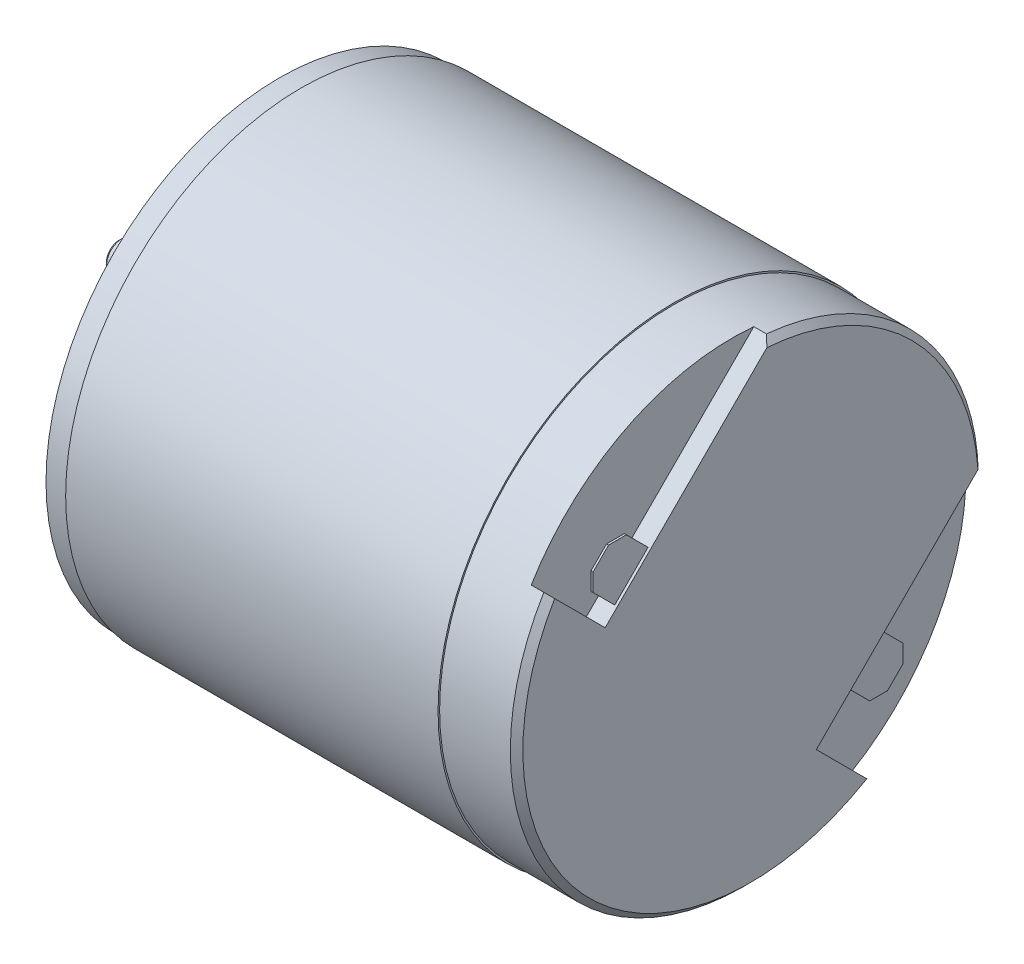
ISO-10303-21;
HEADER;
FILE_DESCRIPTION(('STEP AP214'),'2;1');
FILE_NAME('part.step','',(''),(''),'','','');
FILE_SCHEMA(('AUTOMOTIVE_DESIGN { 1 0 10303 214 1 1 1 1 }'));
ENDSEC;
DATA;
#1=APPLICATION_CONTEXT('core data for automotive mechanical design processes');
#2=APPLICATION_PROTOCOL_DEFINITION('international standard','automotive_design',2000,#1);
#3=PRODUCT_CONTEXT('',#1,'mechanical');
#4=PRODUCT('Part','Part','',(#3));
#5=PRODUCT_RELATED_PRODUCT_CATEGORY('part','',(#4));
#6=PRODUCT_DEFINITION_FORMATION('','',#4);
#7=PRODUCT_DEFINITION_CONTEXT('part definition',#1,'design');
#8=PRODUCT_DEFINITION('design','',#6,#7);
#9=PRODUCT_DEFINITION_SHAPE('','',#8);
#10=(LENGTH_UNIT() NAMED_UNIT(*) SI_UNIT(.MILLI.,.METRE.));
#11=(NAMED_UNIT(*) PLANE_ANGLE_UNIT() SI_UNIT($,.RADIAN.));
#12=(NAMED_UNIT(*) SI_UNIT($,.STERADIAN.) SOLID_ANGLE_UNIT());
#13=UNCERTAINTY_MEASURE_WITH_UNIT(LENGTH_MEASURE(1.E-05),#10,'distance_accuracy_value','');
#14=(GEOMETRIC_REPRESENTATION_CONTEXT(3) GLOBAL_UNCERTAINTY_ASSIGNED_CONTEXT((#13)) GLOBAL_UNIT_ASSIGNED_CONTEXT((#10,
#11,#12)) REPRESENTATION_CONTEXT('',''));
#15=CARTESIAN_POINT('',(0.,0.,0.));
#16=DIRECTION('',(0.,0.,1.));
#17=DIRECTION('',(1.,0.,0.));
#18=AXIS2_PLACEMENT_3D('',#15,#16,#17);
#19=CARTESIAN_POINT('',(0.,0.,0.));
#20=DIRECTION('',(-1.,0.,0.));
#21=DIRECTION('',(0.,0.,1.));
#22=AXIS2_PLACEMENT_3D('',#19,#20,#21);
#23=PLANE('',#22);
#24=DIRECTION('',(0.,0.707106781186548,0.707106781186548));
#25=VECTOR('',#24,1.);
#26=CARTESIAN_POINT('',(0.,-19.0062950903902,-13.9151262658471));
#27=LINE('',#26,#25);
#28=CARTESIAN_POINT('',(0.,4.17193000900063,9.26309883354377));
#29=VERTEX_POINT('',#28);
#30=CARTESIAN_POINT('',(0.,7.38643451642566,12.4776033409688));
#31=VERTEX_POINT('',#30);
#32=EDGE_CURVE('E251',#29,#31,#27,.T.);
#33=ORIENTED_EDGE('',*,*,#32,.T.);
#34=CARTESIAN_POINT('',(0.,0.,0.));
#35=DIRECTION('',(-1.,0.,0.));
#36=DIRECTION('',(0.,0.,1.));
#37=AXIS2_PLACEMENT_3D('',#34,#35,#36);
#38=CIRCLE('',#37,14.5);
#39=CARTESIAN_POINT('',(0.,-12.4776033409688,-7.38643451642566));
#40=VERTEX_POINT('',#39);
#41=EDGE_CURVE('E382',#31,#40,#38,.F.);
#42=ORIENTED_EDGE('',*,*,#41,.T.);
#43=DIRECTION('',(0.,-0.707106781186548,-0.707106781186548));
#44=VECTOR('',#43,1.);
#45=CARTESIAN_POINT('',(0.,-19.0062950903902,-13.9151262658471));
#46=LINE('',#45,#44);
#47=CARTESIAN_POINT('',(0.,-9.26309883354377,-4.17193000900063));
#48=VERTEX_POINT('',#47);
#49=EDGE_CURVE('E237',#48,#40,#46,.T.);
#50=ORIENTED_EDGE('',*,*,#49,.F.);
#51=DIRECTION('',(0.,-0.707106781186547,0.707106781186548));
#52=VECTOR('',#51,1.);
#53=CARTESIAN_POINT('',(0.,9.74319625684644,-23.1782250993909));
#54=LINE('',#53,#52);
#55=CARTESIAN_POINT('',(0.,1.0284522711426,-14.463481113687));
#56=VERTEX_POINT('',#55);
#57=EDGE_CURVE('E235',#56,#48,#54,.T.);
#58=ORIENTED_EDGE('',*,*,#57,.F.);
#59=CARTESIAN_POINT('',(0.,0.,0.));
#60=DIRECTION('',(-1.,0.,0.));
#61=DIRECTION('',(0.,0.,1.));
#62=AXIS2_PLACEMENT_3D('',#59,#60,#61);
#63=CIRCLE('',#62,14.5);
#64=CARTESIAN_POINT('',(0.,14.463481113687,-1.02845227114266));
#65=VERTEX_POINT('',#64);
#66=EDGE_CURVE('E45',#56,#65,#63,.F.);
#67=ORIENTED_EDGE('',*,*,#66,.T.);
#68=DIRECTION('',(0.,-0.707106781186546,0.707106781186549));
#69=VECTOR('',#68,1.);
#70=CARTESIAN_POINT('',(0.,23.1782250993909,-9.74319625684651));
#71=LINE('',#70,#69);
#72=EDGE_CURVE('E259',#65,#29,#71,.T.);
#73=ORIENTED_EDGE('',*,*,#72,.T.);
#74=EDGE_LOOP('',(#33,#42,#50,#58,#67,#73));
#75=FACE_BOUND('',#74,.T.);
#76=ADVANCED_FACE('F31',(#75),#23,.F.);
#77=CARTESIAN_POINT('',(0.,0.,0.));
#78=DIRECTION('',(-1.,0.,0.));
#79=DIRECTION('',(0.,0.,1.));
#80=AXIS2_PLACEMENT_3D('',#77,#78,#79);
#81=CYLINDRICAL_SURFACE('',#80,14.9);
#82=DIRECTION('',(1.,0.,0.));
#83=VECTOR('',#82,1.);
#84=CARTESIAN_POINT('',(-1.2,-12.7693312792475,-7.67816245470436));
#85=LINE('',#84,#83);
#86=CARTESIAN_POINT('',(-1.2,-12.7693312792475,-7.67816245470436));
#87=VERTEX_POINT('',#86);
#88=CARTESIAN_POINT('',(-0.4,-12.7693312792475,-7.67816245470436));
#89=VERTEX_POINT('',#88);
#90=EDGE_CURVE('E252',#87,#89,#85,.T.);
#91=ORIENTED_EDGE('',*,*,#90,.T.);
#92=CARTESIAN_POINT('',(-0.399999999999999,0.,0.));
#93=DIRECTION('',(-1.,0.,0.));
#94=DIRECTION('',(0.,0.,1.));
#95=AXIS2_PLACEMENT_3D('',#92,#93,#94);
#96=CIRCLE('',#95,14.9);
#97=CARTESIAN_POINT('',(-0.4,7.67816245470436,12.7693312792475));
#98=VERTEX_POINT('',#97);
#99=EDGE_CURVE('E348',#89,#98,#96,.T.);
#100=ORIENTED_EDGE('',*,*,#99,.T.);
#101=DIRECTION('',(1.,0.,0.));
#102=VECTOR('',#101,1.);
#103=CARTESIAN_POINT('',(-1.2,7.67816245470436,12.7693312792475));
#104=LINE('',#103,#102);
#105=CARTESIAN_POINT('',(-1.2,7.67816245470436,12.7693312792475));
#106=VERTEX_POINT('',#105);
#107=EDGE_CURVE('E270',#106,#98,#104,.T.);
#108=ORIENTED_EDGE('',*,*,#107,.F.);
#109=CARTESIAN_POINT('',(-1.2,0.,0.));
#110=DIRECTION('',(1.,0.,0.));
#111=DIRECTION('',(0.,0.,-1.));
#112=AXIS2_PLACEMENT_3D('',#109,#110,#111);
#113=CIRCLE('',#112,14.9);
#114=CARTESIAN_POINT('',(-1.2,14.8341639763534,-1.39913513380904));
#115=VERTEX_POINT('',#114);
#116=EDGE_CURVE('E266',#106,#115,#113,.F.);
#117=ORIENTED_EDGE('',*,*,#116,.T.);
#118=DIRECTION('',(1.,0.,0.));
#119=VECTOR('',#118,1.);
#120=CARTESIAN_POINT('',(-1.2,14.8341639763534,-1.39913513380904));
#121=LINE('',#120,#119);
#122=CARTESIAN_POINT('',(-0.399999999999998,14.8341639763534,-1.39913513380904));
#123=VERTEX_POINT('',#122);
#124=EDGE_CURVE('E274',#115,#123,#121,.T.);
#125=ORIENTED_EDGE('',*,*,#124,.T.);
#126=CARTESIAN_POINT('',(-0.399999999999999,0.,0.));
#127=DIRECTION('',(-1.,0.,0.));
#128=DIRECTION('',(0.,0.,1.));
#129=AXIS2_PLACEMENT_3D('',#126,#127,#128);
#130=CIRCLE('',#129,14.9);
#131=CARTESIAN_POINT('',(-0.400000000000001,1.39913513380898,-14.8341639763534));
#132=VERTEX_POINT('',#131);
#133=EDGE_CURVE('E345',#123,#132,#130,.T.);
#134=ORIENTED_EDGE('',*,*,#133,.T.);
#135=DIRECTION('',(1.,0.,0.));
#136=VECTOR('',#135,1.);
#137=CARTESIAN_POINT('',(-1.2,1.39913513380898,-14.8341639763534));
#138=LINE('',#137,#136);
#139=CARTESIAN_POINT('',(-1.2,1.39913513380898,-14.8341639763534));
#140=VERTEX_POINT('',#139);
#141=EDGE_CURVE('E249',#140,#132,#138,.T.);
#142=ORIENTED_EDGE('',*,*,#141,.F.);
#143=CARTESIAN_POINT('',(-1.2,0.,0.));
#144=DIRECTION('',(1.,0.,0.));
#145=DIRECTION('',(0.,0.,-1.));
#146=AXIS2_PLACEMENT_3D('',#143,#144,#145);
#147=CIRCLE('',#146,14.9);
#148=EDGE_CURVE('E245',#140,#87,#147,.F.);
#149=ORIENTED_EDGE('',*,*,#148,.T.);
#150=EDGE_LOOP('',(#91,#100,#108,#117,#125,#134,#142,#149));
#151=FACE_BOUND('',#150,.T.);
#152=CARTESIAN_POINT('',(-4.9,0.,0.));
#153=DIRECTION('',(-1.,0.,0.));
#154=DIRECTION('',(0.,0.,1.));
#155=AXIS2_PLACEMENT_3D('',#152,#153,#154);
#156=CIRCLE('',#155,14.9);
#157=CARTESIAN_POINT('',(-4.9,0.,14.9));
#158=VERTEX_POINT('',#157);
#159=EDGE_CURVE('E302',#158,#158,#156,.T.);
#160=ORIENTED_EDGE('',*,*,#159,.F.);
#161=EDGE_LOOP('',(#160));
#162=FACE_BOUND('',#161,.T.);
#163=ADVANCED_FACE('F424',(#151,#162),#81,.T.);
#164=CARTESIAN_POINT('',(-4.9,14.9,0.));
#165=DIRECTION('',(-1.,0.,0.));
#166=DIRECTION('',(0.,0.,1.));
#167=AXIS2_PLACEMENT_3D('',#164,#165,#166);
#168=PLANE('',#167);
#169=CARTESIAN_POINT('',(-4.9,0.,0.));
#170=DIRECTION('',(-1.,0.,0.));
#171=DIRECTION('',(0.,0.,1.));
#172=AXIS2_PLACEMENT_3D('',#169,#170,#171);
#173=CIRCLE('',#172,15.);
#174=CARTESIAN_POINT('',(-4.9,0.,15.));
#175=VERTEX_POINT('',#174);
#176=EDGE_CURVE('E299',#175,#175,#173,.T.);
#177=ORIENTED_EDGE('',*,*,#176,.F.);
#178=EDGE_LOOP('',(#177));
#179=FACE_BOUND('',#178,.T.);
#180=ORIENTED_EDGE('',*,*,#159,.T.);
#181=EDGE_LOOP('',(#180));
#182=FACE_BOUND('',#181,.T.);
#183=ADVANCED_FACE('F428',(#179,#182),#168,.F.);
#184=CARTESIAN_POINT('',(0.,0.,0.));
#185=DIRECTION('',(-1.,0.,0.));
#186=DIRECTION('',(0.,0.,1.));
#187=AXIS2_PLACEMENT_3D('',#184,#185,#186);
#188=CYLINDRICAL_SURFACE('',#187,15.);
#189=CARTESIAN_POINT('',(-28.6,0.,0.));
#190=DIRECTION('',(-1.,0.,0.));
#191=DIRECTION('',(0.,0.,1.));
#192=AXIS2_PLACEMENT_3D('',#189,#190,#191);
#193=CIRCLE('',#192,15.);
#194=CARTESIAN_POINT('',(-28.6,0.,15.));
#195=VERTEX_POINT('',#194);
#196=EDGE_CURVE('E296',#195,#195,#193,.T.);
#197=ORIENTED_EDGE('',*,*,#196,.F.);
#198=EDGE_LOOP('',(#197));
#199=FACE_BOUND('',#198,.T.);
#200=ORIENTED_EDGE('',*,*,#176,.T.);
#201=EDGE_LOOP('',(#200));
#202=FACE_BOUND('',#201,.T.);
#203=ADVANCED_FACE('F487',(#199,#202),#188,.T.);
#204=CARTESIAN_POINT('',(-28.6,15.,0.));
#205=DIRECTION('',(1.,0.,0.));
#206=DIRECTION('',(0.,0.,-1.));
#207=AXIS2_PLACEMENT_3D('',#204,#205,#206);
#208=PLANE('',#207);
#209=CARTESIAN_POINT('',(-28.6,0.,0.));
#210=DIRECTION('',(-1.,0.,0.));
#211=DIRECTION('',(0.,0.,1.));
#212=AXIS2_PLACEMENT_3D('',#209,#210,#211);
#213=CIRCLE('',#212,14.85);
#214=CARTESIAN_POINT('',(-28.6,0.,14.85));
#215=VERTEX_POINT('',#214);
#216=EDGE_CURVE('E293',#215,#215,#213,.T.);
#217=ORIENTED_EDGE('',*,*,#216,.F.);
#218=EDGE_LOOP('',(#217));
#219=FACE_BOUND('',#218,.T.);
#220=ORIENTED_EDGE('',*,*,#196,.T.);
#221=EDGE_LOOP('',(#220));
#222=FACE_BOUND('',#221,.T.);
#223=ADVANCED_FACE('F483',(#219,#222),#208,.F.);
#224=CARTESIAN_POINT('',(0.,0.,0.));
#225=DIRECTION('',(-1.,0.,0.));
#226=DIRECTION('',(0.,0.,1.));
#227=AXIS2_PLACEMENT_3D('',#224,#225,#226);
#228=CYLINDRICAL_SURFACE('',#227,14.85);
#229=CARTESIAN_POINT('',(-30.,0.,0.));
#230=DIRECTION('',(-1.,0.,0.));
#231=DIRECTION('',(0.,0.,1.));
#232=AXIS2_PLACEMENT_3D('',#229,#230,#231);
#233=CIRCLE('',#232,14.85);
#234=CARTESIAN_POINT('',(-30.,0.,14.85));
#235=VERTEX_POINT('',#234);
#236=EDGE_CURVE('E290',#235,#235,#233,.T.);
#237=ORIENTED_EDGE('',*,*,#236,.F.);
#238=EDGE_LOOP('',(#237));
#239=FACE_BOUND('',#238,.T.);
#240=ORIENTED_EDGE('',*,*,#216,.T.);
#241=EDGE_LOOP('',(#240));
#242=FACE_BOUND('',#241,.T.);
#243=ADVANCED_FACE('F479',(#239,#242),#228,.T.);
#244=CARTESIAN_POINT('',(-30.,14.85,0.));
#245=DIRECTION('',(1.,0.,0.));
#246=DIRECTION('',(0.,0.,-1.));
#247=AXIS2_PLACEMENT_3D('',#244,#245,#246);
#248=PLANE('',#247);
#249=CARTESIAN_POINT('',(-30.,0.,0.));
#250=DIRECTION('',(-1.,0.,0.));
#251=DIRECTION('',(0.,0.,1.));
#252=AXIS2_PLACEMENT_3D('',#249,#250,#251);
#253=CIRCLE('',#252,4.);
#254=CARTESIAN_POINT('',(-30.,0.,4.));
#255=VERTEX_POINT('',#254);
#256=EDGE_CURVE('E287',#255,#255,#253,.T.);
#257=ORIENTED_EDGE('',*,*,#256,.F.);
#258=EDGE_LOOP('',(#257));
#259=FACE_BOUND('',#258,.T.);
#260=ORIENTED_EDGE('',*,*,#236,.T.);
#261=EDGE_LOOP('',(#260));
#262=FACE_BOUND('',#261,.T.);
#263=ADVANCED_FACE('F475',(#259,#262),#248,.F.);
#264=CARTESIAN_POINT('',(0.,0.,0.));
#265=DIRECTION('',(-1.,0.,0.));
#266=DIRECTION('',(0.,0.,1.));
#267=AXIS2_PLACEMENT_3D('',#264,#265,#266);
#268=CYLINDRICAL_SURFACE('',#267,4.);
#269=CARTESIAN_POINT('',(-30.9,0.,0.));
#270=DIRECTION('',(-1.,0.,0.));
#271=DIRECTION('',(0.,0.,1.));
#272=AXIS2_PLACEMENT_3D('',#269,#270,#271);
#273=CIRCLE('',#272,4.);
#274=CARTESIAN_POINT('',(-30.9,0.,4.));
#275=VERTEX_POINT('',#274);
#276=EDGE_CURVE('E284',#275,#275,#273,.T.);
#277=ORIENTED_EDGE('',*,*,#276,.F.);
#278=EDGE_LOOP('',(#277));
#279=FACE_BOUND('',#278,.T.);
#280=ORIENTED_EDGE('',*,*,#256,.T.);
#281=EDGE_LOOP('',(#280));
#282=FACE_BOUND('',#281,.T.);
#283=ADVANCED_FACE('F471',(#279,#282),#268,.T.);
#284=CARTESIAN_POINT('',(-30.9,4.,0.));
#285=DIRECTION('',(1.,0.,0.));
#286=DIRECTION('',(0.,0.,-1.));
#287=AXIS2_PLACEMENT_3D('',#284,#285,#286);
#288=PLANE('',#287);
#289=CARTESIAN_POINT('',(-30.9,0.,0.));
#290=DIRECTION('',(-1.,0.,0.));
#291=DIRECTION('',(0.,0.,1.));
#292=AXIS2_PLACEMENT_3D('',#289,#290,#291);
#293=CIRCLE('',#292,2.1);
#294=CARTESIAN_POINT('',(-30.9,0.,2.1));
#295=VERTEX_POINT('',#294);
#296=EDGE_CURVE('E281',#295,#295,#293,.T.);
#297=ORIENTED_EDGE('',*,*,#296,.F.);
#298=EDGE_LOOP('',(#297));
#299=FACE_BOUND('',#298,.T.);
#300=ORIENTED_EDGE('',*,*,#276,.T.);
#301=EDGE_LOOP('',(#300));
#302=FACE_BOUND('',#301,.T.);
#303=ADVANCED_FACE('F467',(#299,#302),#288,.F.);
#304=CARTESIAN_POINT('',(0.,0.,0.));
#305=DIRECTION('',(-1.,0.,0.));
#306=DIRECTION('',(0.,0.,1.));
#307=AXIS2_PLACEMENT_3D('',#304,#305,#306);
#308=CYLINDRICAL_SURFACE('',#307,2.1);
#309=CARTESIAN_POINT('',(-31.8,0.,0.));
#310=DIRECTION('',(1.,0.,0.));
#311=DIRECTION('',(0.,0.,-1.));
#312=AXIS2_PLACEMENT_3D('',#309,#310,#311);
#313=CIRCLE('',#312,2.1);
#314=CARTESIAN_POINT('',(-31.8,0.,-2.1));
#315=VERTEX_POINT('',#314);
#316=EDGE_CURVE('E11',#315,#315,#313,.T.);
#317=ORIENTED_EDGE('',*,*,#316,.T.);
#318=EDGE_LOOP('',(#317));
#319=FACE_BOUND('',#318,.T.);
#320=ORIENTED_EDGE('',*,*,#296,.T.);
#321=EDGE_LOOP('',(#320));
#322=FACE_BOUND('',#321,.T.);
#323=ADVANCED_FACE('F464',(#319,#322),#308,.T.);
#324=CARTESIAN_POINT('',(-32.,2.1,0.));
#325=DIRECTION('',(1.,0.,0.));
#326=DIRECTION('',(0.,0.,-1.));
#327=AXIS2_PLACEMENT_3D('',#324,#325,#326);
#328=PLANE('',#327);
#329=CARTESIAN_POINT('',(-32.,0.,0.));
#330=DIRECTION('',(1.,0.,0.));
#331=DIRECTION('',(0.,0.,-1.));
#332=AXIS2_PLACEMENT_3D('',#329,#330,#331);
#333=CIRCLE('',#332,1.98452994616208);
#334=CARTESIAN_POINT('',(-32.,0.,-1.98452994616208));
#335=VERTEX_POINT('',#334);
#336=EDGE_CURVE('E38',#335,#335,#333,.F.);
#337=ORIENTED_EDGE('',*,*,#336,.T.);
#338=EDGE_LOOP('',(#337));
#339=FACE_BOUND('',#338,.T.);
#340=CARTESIAN_POINT('',(-32.,0.,0.));
#341=DIRECTION('',(-1.,0.,0.));
#342=DIRECTION('',(0.,0.,1.));
#343=AXIS2_PLACEMENT_3D('',#340,#341,#342);
#344=CIRCLE('',#343,1.);
#345=CARTESIAN_POINT('',(-32.,0.,1.));
#346=VERTEX_POINT('',#345);
#347=EDGE_CURVE('E273',#346,#346,#344,.T.);
#348=ORIENTED_EDGE('',*,*,#347,.F.);
#349=EDGE_LOOP('',(#348));
#350=FACE_BOUND('',#349,.T.);
#351=ADVANCED_FACE('F412',(#339,#350),#328,.F.);
#352=CARTESIAN_POINT('',(0.,0.,0.));
#353=DIRECTION('',(-1.,0.,0.));
#354=DIRECTION('',(0.,0.,1.));
#355=AXIS2_PLACEMENT_3D('',#352,#353,#354);
#356=CYLINDRICAL_SURFACE('',#355,1.);
#357=CARTESIAN_POINT('',(-40.,0.,0.));
#358=DIRECTION('',(1.,0.,0.));
#359=DIRECTION('',(0.,0.,-1.));
#360=AXIS2_PLACEMENT_3D('',#357,#358,#359);
#361=CIRCLE('',#360,1.);
#362=CARTESIAN_POINT('',(-40.,0.,-1.));
#363=VERTEX_POINT('',#362);
#364=EDGE_CURVE('E308',#363,#363,#361,.T.);
#365=ORIENTED_EDGE('',*,*,#364,.T.);
#366=EDGE_LOOP('',(#365));
#367=FACE_BOUND('',#366,.T.);
#368=ORIENTED_EDGE('',*,*,#347,.T.);
#369=EDGE_LOOP('',(#368));
#370=FACE_BOUND('',#369,.T.);
#371=ADVANCED_FACE('F454',(#367,#370),#356,.T.);
#372=CARTESIAN_POINT('',(-40.2,0.999999999999999,0.));
#373=DIRECTION('',(1.,0.,0.));
#374=DIRECTION('',(0.,0.,-1.));
#375=AXIS2_PLACEMENT_3D('',#372,#373,#374);
#376=PLANE('',#375);
#377=CARTESIAN_POINT('',(-40.2,0.,0.));
#378=DIRECTION('',(1.,0.,0.));
#379=DIRECTION('',(0.,0.,-1.));
#380=AXIS2_PLACEMENT_3D('',#377,#378,#379);
#381=CIRCLE('',#380,0.800000000000002);
#382=CARTESIAN_POINT('',(-40.2,0.,-0.800000000000002));
#383=VERTEX_POINT('',#382);
#384=EDGE_CURVE('E305',#383,#383,#381,.F.);
#385=ORIENTED_EDGE('',*,*,#384,.T.);
#386=EDGE_LOOP('',(#385));
#387=FACE_BOUND('',#386,.T.);
#388=ADVANCED_FACE('F450',(#387),#376,.F.);
#389=CARTESIAN_POINT('',(-1.2,-19.0062950903902,-13.9151262658471));
#390=DIRECTION('',(0.,0.707106781186548,-0.707106781186548));
#391=DIRECTION('',(0.,0.707106781186548,0.707106781186548));
#392=AXIS2_PLACEMENT_3D('',#389,#390,#391);
#393=PLANE('',#392);
#394=ORIENTED_EDGE('',*,*,#107,.T.);
#395=CARTESIAN_POINT('',(-0.399999999999999,7.67816245470436,12.7693312792475));
#396=CARTESIAN_POINT('',(-0.333303497507687,7.62956158627321,12.7207304108163));
#397=CARTESIAN_POINT('',(-0.266621912949534,7.58095049054999,12.6721193150931));
#398=CARTESIAN_POINT('',(-0.133288579616163,7.48370784445712,12.5748766690003));
#399=CARTESIAN_POINT('',(-0.0666368308409822,7.43507629408744,12.5262451186306));
#400=CARTESIAN_POINT('',(0.,7.38643451642566,12.4776033409688));
#401=B_SPLINE_CURVE_WITH_KNOTS('',3,(#395,#396,#397,#398,#399,#400),.UNSPECIFIED.,.F.,.F.,(4,2,
4),(0.,0.287319680436435,0.574639361240867),.UNSPECIFIED.);
#402=EDGE_CURVE('E351',#98,#31,#401,.T.);
#403=ORIENTED_EDGE('',*,*,#402,.T.);
#404=ORIENTED_EDGE('',*,*,#32,.F.);
#405=DIRECTION('',(1.,0.,0.));
#406=VECTOR('',#405,1.);
#407=CARTESIAN_POINT('',(-1.2,4.17193000900063,9.26309883354377));
#408=LINE('',#407,#406);
#409=CARTESIAN_POINT('',(-1.2,4.17193000900063,9.26309883354377));
#410=VERTEX_POINT('',#409);
#411=EDGE_CURVE('E269',#410,#29,#408,.T.);
#412=ORIENTED_EDGE('',*,*,#411,.F.);
#413=DIRECTION('',(0.,0.707106781186548,0.707106781186548));
#414=VECTOR('',#413,1.);
#415=CARTESIAN_POINT('',(-1.2,-19.0062950903902,-13.9151262658471));
#416=LINE('',#415,#414);
#417=EDGE_CURVE('E261',#410,#106,#416,.T.);
#418=ORIENTED_EDGE('',*,*,#417,.T.);
#419=EDGE_LOOP('',(#394,#403,#404,#412,#418));
#420=FACE_BOUND('',#419,.T.);
#421=ADVANCED_FACE('F359',(#420),#393,.T.);
#422=CARTESIAN_POINT('',(-1.2,23.1782250993909,-9.74319625684651));
#423=DIRECTION('',(0.,0.707106781186549,0.707106781186546));
#424=DIRECTION('',(0.,-0.707106781186546,0.707106781186549));
#425=AXIS2_PLACEMENT_3D('',#422,#423,#424);
#426=PLANE('',#425);
#427=DIRECTION('',(0.,0.707106781186548,-0.707106781186548));
#428=VECTOR('',#427,1.);
#429=CARTESIAN_POINT('',(-0.17,4.94974746830581,8.48528137423855));
#430=LINE('',#429,#428);
#431=CARTESIAN_POINT('',(-0.17,4.94974746830581,8.48528137423855));
#432=VERTEX_POINT('',#431);
#433=CARTESIAN_POINT('',(-0.17,7.07106781186546,6.36396103067891));
#434=VERTEX_POINT('',#433);
#435=EDGE_CURVE('E219',#432,#434,#430,.T.);
#436=ORIENTED_EDGE('',*,*,#435,.F.);
#437=DIRECTION('',(-1.,0.,0.));
#438=VECTOR('',#437,1.);
#439=CARTESIAN_POINT('',(-0.17,4.94974746830581,8.48528137423855));
#440=LINE('',#439,#438);
#441=CARTESIAN_POINT('',(-0.3,4.94974746830581,8.48528137423855));
#442=VERTEX_POINT('',#441);
#443=EDGE_CURVE('E230',#432,#442,#440,.T.);
#444=ORIENTED_EDGE('',*,*,#443,.T.);
#445=DIRECTION('',(0.,0.707106781186548,-0.707106781186548));
#446=VECTOR('',#445,1.);
#447=CARTESIAN_POINT('',(-0.3,4.94974746830581,8.48528137423855));
#448=LINE('',#447,#446);
#449=CARTESIAN_POINT('',(-0.3,7.07106781186548,6.36396103067892));
#450=VERTEX_POINT('',#449);
#451=EDGE_CURVE('E185',#442,#450,#448,.T.);
#452=ORIENTED_EDGE('',*,*,#451,.T.);
#453=DIRECTION('',(-1.,0.,0.));
#454=VECTOR('',#453,1.);
#455=CARTESIAN_POINT('',(-0.17,7.07106781186546,6.36396103067891));
#456=LINE('',#455,#454);
#457=EDGE_CURVE('E233',#434,#450,#456,.T.);
#458=ORIENTED_EDGE('',*,*,#457,.F.);
#459=EDGE_LOOP('',(#436,#444,#452,#458));
#460=FACE_BOUND('',#459,.T.);
#461=ORIENTED_EDGE('',*,*,#72,.F.);
#462=CARTESIAN_POINT('',(0.,14.463481113687,-1.02845227114266));
#463=CARTESIAN_POINT('',(-0.0662553103929144,14.5254835432952,-1.0904547007508));
#464=CARTESIAN_POINT('',(-0.132716301451681,14.5873749989757,-1.15234615643128));
#465=CARTESIAN_POINT('',(-0.266049634847051,14.7109359531643,-1.27590711061993));
#466=CARTESIAN_POINT('',(-0.332921977121617,14.7726054517059,-1.33757660916158));
#467=CARTESIAN_POINT('',(-0.399999999999999,14.8341639763534,-1.39913513380904));
#468=B_SPLINE_CURVE_WITH_KNOTS('',3,(#462,#463,#464,#465,#466,#467),.UNSPECIFIED.,.F.,.F.,(4,2,
4),(0.,0.32970215520239,0.659404260683057),.UNSPECIFIED.);
#469=EDGE_CURVE('E405',#65,#123,#468,.T.);
#470=ORIENTED_EDGE('',*,*,#469,.T.);
#471=ORIENTED_EDGE('',*,*,#124,.F.);
#472=DIRECTION('',(0.,-0.707106781186546,0.707106781186549));
#473=VECTOR('',#472,1.);
#474=CARTESIAN_POINT('',(-1.2,23.1782250993909,-9.74319625684651));
#475=LINE('',#474,#473);
#476=EDGE_CURVE('E264',#115,#410,#475,.T.);
#477=ORIENTED_EDGE('',*,*,#476,.T.);
#478=ORIENTED_EDGE('',*,*,#411,.T.);
#479=EDGE_LOOP('',(#461,#470,#471,#477,#478));
#480=FACE_BOUND('',#479,.T.);
#481=ADVANCED_FACE('F400',(#460,#480),#426,.T.);
#482=CARTESIAN_POINT('',(-1.2,0.,-32.9214213562373));
#483=DIRECTION('',(1.,0.,0.));
#484=DIRECTION('',(0.,0.,-1.));
#485=AXIS2_PLACEMENT_3D('',#482,#483,#484);
#486=PLANE('',#485);
#487=ORIENTED_EDGE('',*,*,#417,.F.);
#488=ORIENTED_EDGE('',*,*,#476,.F.);
#489=ORIENTED_EDGE('',*,*,#116,.F.);
#490=EDGE_LOOP('',(#487,#488,#489));
#491=FACE_BOUND('',#490,.T.);
#492=ADVANCED_FACE('F398',(#491),#486,.T.);
#493=CARTESIAN_POINT('',(-1.2,9.74319625684644,-23.1782250993909));
#494=DIRECTION('',(0.,0.707106781186548,0.707106781186547));
#495=DIRECTION('',(0.,-0.707106781186547,0.707106781186548));
#496=AXIS2_PLACEMENT_3D('',#493,#494,#495);
#497=PLANE('',#496);
#498=DIRECTION('',(-1.,0.,0.));
#499=VECTOR('',#498,1.);
#500=CARTESIAN_POINT('',(-0.17,-7.07106781186549,-6.36396103067895));
#501=LINE('',#500,#499);
#502=CARTESIAN_POINT('',(-0.17,-7.07106781186548,-6.36396103067893));
#503=VERTEX_POINT('',#502);
#504=CARTESIAN_POINT('',(-0.3,-7.07106781186546,-6.36396103067895));
#505=VERTEX_POINT('',#504);
#506=EDGE_CURVE('E186',#503,#505,#501,.T.);
#507=ORIENTED_EDGE('',*,*,#506,.F.);
#508=DIRECTION('',(0.,-0.707106781186548,0.707106781186547));
#509=VECTOR('',#508,1.);
#510=CARTESIAN_POINT('',(-0.17,-4.94974746830585,-8.48528137423859));
#511=LINE('',#510,#509);
#512=CARTESIAN_POINT('',(-0.17,-4.94974746830583,-8.48528137423858));
#513=VERTEX_POINT('',#512);
#514=EDGE_CURVE('E184',#513,#503,#511,.T.);
#515=ORIENTED_EDGE('',*,*,#514,.F.);
#516=DIRECTION('',(-1.,0.,0.));
#517=VECTOR('',#516,1.);
#518=CARTESIAN_POINT('',(-0.17,-4.94974746830585,-8.48528137423859));
#519=LINE('',#518,#517);
#520=CARTESIAN_POINT('',(-0.3,-4.94974746830585,-8.48528137423859));
#521=VERTEX_POINT('',#520);
#522=EDGE_CURVE('E172',#513,#521,#519,.T.);
#523=ORIENTED_EDGE('',*,*,#522,.T.);
#524=DIRECTION('',(0.,-0.707106781186548,0.707106781186547));
#525=VECTOR('',#524,1.);
#526=CARTESIAN_POINT('',(-0.3,-4.94974746830585,-8.48528137423859));
#527=LINE('',#526,#525);
#528=EDGE_CURVE('E177',#521,#505,#527,.T.);
#529=ORIENTED_EDGE('',*,*,#528,.T.);
#530=EDGE_LOOP('',(#507,#515,#523,#529));
#531=FACE_BOUND('',#530,.T.);
#532=ORIENTED_EDGE('',*,*,#141,.T.);
#533=CARTESIAN_POINT('',(-0.399999999999999,1.39913513380898,-14.8341639763534));
#534=CARTESIAN_POINT('',(-0.332921977121616,1.33757660916152,-14.772605451706));
#535=CARTESIAN_POINT('',(-0.266049634847049,1.27590711061988,-14.7109359531643));
#536=CARTESIAN_POINT('',(-0.132716301451679,1.15234615643123,-14.5873749989757));
#537=CARTESIAN_POINT('',(-0.0662553103929133,1.09045470075074,-14.5254835432952));
#538=CARTESIAN_POINT('',(0.,1.02845227114261,-14.463481113687));
#539=B_SPLINE_CURVE_WITH_KNOTS('',3,(#533,#534,#535,#536,#537,#538),.UNSPECIFIED.,.F.,.F.,(4,2,
4),(0.,0.329702105480666,0.659404260683055),.UNSPECIFIED.);
#540=EDGE_CURVE('E53',#132,#56,#539,.T.);
#541=ORIENTED_EDGE('',*,*,#540,.T.);
#542=ORIENTED_EDGE('',*,*,#57,.T.);
#543=DIRECTION('',(1.,0.,0.));
#544=VECTOR('',#543,1.);
#545=CARTESIAN_POINT('',(-1.2,-9.26309883354377,-4.17193000900063));
#546=LINE('',#545,#544);
#547=CARTESIAN_POINT('',(-1.2,-9.26309883354377,-4.17193000900063));
#548=VERTEX_POINT('',#547);
#549=EDGE_CURVE('E248',#548,#48,#546,.T.);
#550=ORIENTED_EDGE('',*,*,#549,.F.);
#551=DIRECTION('',(0.,-0.707106781186547,0.707106781186548));
#552=VECTOR('',#551,1.);
#553=CARTESIAN_POINT('',(-1.2,9.74319625684644,-23.1782250993909));
#554=LINE('',#553,#552);
#555=EDGE_CURVE('E240',#140,#548,#554,.T.);
#556=ORIENTED_EDGE('',*,*,#555,.F.);
#557=EDGE_LOOP('',(#532,#541,#542,#550,#556));
#558=FACE_BOUND('',#557,.T.);
#559=ADVANCED_FACE('F181',(#531,#558),#497,.F.);
#560=CARTESIAN_POINT('',(-1.2,-19.0062950903902,-13.9151262658471));
#561=DIRECTION('',(0.,-0.707106781186548,0.707106781186548));
#562=DIRECTION('',(0.,-0.707106781186548,-0.707106781186548));
#563=AXIS2_PLACEMENT_3D('',#560,#561,#562);
#564=PLANE('',#563);
#565=ORIENTED_EDGE('',*,*,#49,.T.);
#566=CARTESIAN_POINT('',(0.,-12.4776033409688,-7.38643451642566));
#567=CARTESIAN_POINT('',(-0.0666368308409826,-12.5262451186306,-7.43507629408744));
#568=CARTESIAN_POINT('',(-0.133288579616163,-12.5748766690003,-7.48370784445712));
#569=CARTESIAN_POINT('',(-0.266621912949535,-12.6721193150931,-7.58095049054999));
#570=CARTESIAN_POINT('',(-0.333303497507687,-12.7207304108163,-7.62956158627321));
#571=CARTESIAN_POINT('',(-0.399999999999999,-12.7693312792475,-7.67816245470436));
#572=B_SPLINE_CURVE_WITH_KNOTS('',3,(#566,#567,#568,#569,#570,#571),.UNSPECIFIED.,.F.,.F.,(4,2,
4),(0.,0.287319680804432,0.574639361240866),.UNSPECIFIED.);
#573=EDGE_CURVE('E376',#40,#89,#572,.T.);
#574=ORIENTED_EDGE('',*,*,#573,.T.);
#575=ORIENTED_EDGE('',*,*,#90,.F.);
#576=DIRECTION('',(0.,-0.707106781186548,-0.707106781186548));
#577=VECTOR('',#576,1.);
#578=CARTESIAN_POINT('',(-1.2,-19.0062950903902,-13.9151262658471));
#579=LINE('',#578,#577);
#580=EDGE_CURVE('E243',#548,#87,#579,.T.);
#581=ORIENTED_EDGE('',*,*,#580,.F.);
#582=ORIENTED_EDGE('',*,*,#549,.T.);
#583=EDGE_LOOP('',(#565,#574,#575,#581,#582));
#584=FACE_BOUND('',#583,.T.);
#585=ADVANCED_FACE('F388',(#584),#564,.F.);
#586=CARTESIAN_POINT('',(-1.2,0.,-32.9214213562373));
#587=DIRECTION('',(1.,0.,0.));
#588=DIRECTION('',(0.,0.,-1.));
#589=AXIS2_PLACEMENT_3D('',#586,#587,#588);
#590=PLANE('',#589);
#591=ORIENTED_EDGE('',*,*,#555,.T.);
#592=ORIENTED_EDGE('',*,*,#580,.T.);
#593=ORIENTED_EDGE('',*,*,#148,.F.);
#594=EDGE_LOOP('',(#591,#592,#593));
#595=FACE_BOUND('',#594,.T.);
#596=ADVANCED_FACE('F392',(#595),#590,.T.);
#597=CARTESIAN_POINT('',(-40.2,0.,0.));
#598=DIRECTION('',(1.,0.,0.));
#599=DIRECTION('',(0.,0.,-1.));
#600=AXIS2_PLACEMENT_3D('',#597,#598,#599);
#601=CONICAL_SURFACE('',#600,0.800000000000002,0.785398163397462);
#602=ORIENTED_EDGE('',*,*,#364,.F.);
#603=EDGE_LOOP('',(#602));
#604=FACE_BOUND('',#603,.T.);
#605=ORIENTED_EDGE('',*,*,#384,.F.);
#606=EDGE_LOOP('',(#605));
#607=FACE_BOUND('',#606,.T.);
#608=ADVANCED_FACE('F554',(#604,#607),#601,.T.);
#609=CARTESIAN_POINT('',(-0.17,7.07106781186546,6.36396103067891));
#610=DIRECTION('',(0.,-0.707106781186547,0.707106781186547));
#611=DIRECTION('',(0.,-0.707106781186548,-0.707106781186548));
#612=AXIS2_PLACEMENT_3D('',#609,#610,#611);
#613=PLANE('',#612);
#614=DIRECTION('',(0.,0.707106781186548,0.707106781186548));
#615=VECTOR('',#614,1.);
#616=CARTESIAN_POINT('',(-0.3,7.07106781186546,6.36396103067891));
#617=LINE('',#616,#615);
#618=CARTESIAN_POINT('',(-0.3,8.44992603517922,7.74281925399267));
#619=VERTEX_POINT('',#618);
#620=EDGE_CURVE('E211',#450,#619,#617,.T.);
#621=ORIENTED_EDGE('',*,*,#620,.T.);
#622=DIRECTION('',(1.,0.,0.));
#623=VECTOR('',#622,1.);
#624=CARTESIAN_POINT('',(-0.17,8.44992603517922,7.74281925399267));
#625=LINE('',#624,#623);
#626=CARTESIAN_POINT('',(-0.17,8.44992603517922,7.74281925399267));
#627=VERTEX_POINT('',#626);
#628=EDGE_CURVE('E343',#619,#627,#625,.T.);
#629=ORIENTED_EDGE('',*,*,#628,.T.);
#630=DIRECTION('',(0.,0.707106781186548,0.707106781186548));
#631=VECTOR('',#630,1.);
#632=CARTESIAN_POINT('',(-0.17,7.07106781186546,6.36396103067891));
#633=LINE('',#632,#631);
#634=EDGE_CURVE('E222',#434,#627,#633,.T.);
#635=ORIENTED_EDGE('',*,*,#634,.F.);
#636=ORIENTED_EDGE('',*,*,#457,.T.);
#637=EDGE_LOOP('',(#621,#629,#635,#636));
#638=FACE_BOUND('',#637,.T.);
#639=ADVANCED_FACE('F559',(#638),#613,.F.);
#640=CARTESIAN_POINT('',(-0.17,9.01561146012846,8.30850467894192));
#641=DIRECTION('',(0.,-0.707106781186547,-0.707106781186548));
#642=DIRECTION('',(0.,0.707106781186548,-0.707106781186547));
#643=AXIS2_PLACEMENT_3D('',#640,#641,#642);
#644=PLANE('',#643);
#645=DIRECTION('',(0.,-0.707106781186548,0.707106781186547));
#646=VECTOR('',#645,1.);
#647=CARTESIAN_POINT('',(-0.3,9.01561146012846,8.30850467894192));
#648=LINE('',#647,#646);
#649=CARTESIAN_POINT('',(-0.3,8.44992603517922,8.87419010389116));
#650=VERTEX_POINT('',#649);
#651=CARTESIAN_POINT('',(-0.3,7.45997654151806,9.86413959755232));
#652=VERTEX_POINT('',#651);
#653=EDGE_CURVE('E214',#650,#652,#648,.T.);
#654=ORIENTED_EDGE('',*,*,#653,.T.);
#655=DIRECTION('',(1.,0.,0.));
#656=VECTOR('',#655,1.);
#657=CARTESIAN_POINT('',(-0.17,7.45997654151806,9.86413959755232));
#658=LINE('',#657,#656);
#659=CARTESIAN_POINT('',(-0.17,7.45997654151806,9.86413959755232));
#660=VERTEX_POINT('',#659);
#661=EDGE_CURVE('E337',#652,#660,#658,.T.);
#662=ORIENTED_EDGE('',*,*,#661,.T.);
#663=DIRECTION('',(0.,-0.707106781186548,0.707106781186547));
#664=VECTOR('',#663,1.);
#665=CARTESIAN_POINT('',(-0.17,9.01561146012846,8.30850467894192));
#666=LINE('',#665,#664);
#667=CARTESIAN_POINT('',(-0.17,8.44992603517922,8.87419010389116));
#668=VERTEX_POINT('',#667);
#669=EDGE_CURVE('E225',#668,#660,#666,.T.);
#670=ORIENTED_EDGE('',*,*,#669,.F.);
#671=DIRECTION('',(-1.,0.,0.));
#672=VECTOR('',#671,1.);
#673=CARTESIAN_POINT('',(-0.17,8.44992603517922,8.87419010389116));
#674=LINE('',#673,#672);
#675=EDGE_CURVE('E334',#668,#650,#674,.T.);
#676=ORIENTED_EDGE('',*,*,#675,.T.);
#677=EDGE_LOOP('',(#654,#662,#670,#676));
#678=FACE_BOUND('',#677,.T.);
#679=ADVANCED_FACE('F568',(#678),#644,.F.);
#680=CARTESIAN_POINT('',(-0.17,6.89429111656882,10.4298250225016));
#681=DIRECTION('',(0.,0.707106781186548,-0.707106781186547));
#682=DIRECTION('',(0.,0.707106781186547,0.707106781186548));
#683=AXIS2_PLACEMENT_3D('',#680,#681,#682);
#684=PLANE('',#683);
#685=DIRECTION('',(0.,-0.707106781186547,-0.707106781186548));
#686=VECTOR('',#685,1.);
#687=CARTESIAN_POINT('',(-0.17,6.89429111656882,10.4298250225016));
#688=LINE('',#687,#686);
#689=CARTESIAN_POINT('',(-0.17,6.32860569161958,9.86413959755232));
#690=VERTEX_POINT('',#689);
#691=EDGE_CURVE('E228',#690,#432,#688,.T.);
#692=ORIENTED_EDGE('',*,*,#691,.F.);
#693=DIRECTION('',(-1.,0.,0.));
#694=VECTOR('',#693,1.);
#695=CARTESIAN_POINT('',(-0.17,6.32860569161958,9.86413959755232));
#696=LINE('',#695,#694);
#697=CARTESIAN_POINT('',(-0.3,6.32860569161958,9.86413959755232));
#698=VERTEX_POINT('',#697);
#699=EDGE_CURVE('E327',#690,#698,#696,.T.);
#700=ORIENTED_EDGE('',*,*,#699,.T.);
#701=DIRECTION('',(0.,-0.707106781186547,-0.707106781186548));
#702=VECTOR('',#701,1.);
#703=CARTESIAN_POINT('',(-0.3,6.89429111656882,10.4298250225016));
#704=LINE('',#703,#702);
#705=EDGE_CURVE('E217',#698,#442,#704,.T.);
#706=ORIENTED_EDGE('',*,*,#705,.T.);
#707=ORIENTED_EDGE('',*,*,#443,.F.);
#708=EDGE_LOOP('',(#692,#700,#706,#707));
#709=FACE_BOUND('',#708,.T.);
#710=ADVANCED_FACE('F578',(#709),#684,.F.);
#711=CARTESIAN_POINT('',(-0.17,7.07106781186546,6.36396103067891));
#712=DIRECTION('',(1.,0.,0.));
#713=DIRECTION('',(0.,0.,-1.));
#714=AXIS2_PLACEMENT_3D('',#711,#712,#713);
#715=PLANE('',#714);
#716=ORIENTED_EDGE('',*,*,#669,.T.);
#717=DIRECTION('',(0.,1.,0.));
#718=VECTOR('',#717,1.);
#719=CARTESIAN_POINT('',(-0.17,7.07106781186547,9.86413959755232));
#720=LINE('',#719,#718);
#721=EDGE_CURVE('E341',#660,#690,#720,.F.);
#722=ORIENTED_EDGE('',*,*,#721,.T.);
#723=ORIENTED_EDGE('',*,*,#691,.T.);
#724=ORIENTED_EDGE('',*,*,#435,.T.);
#725=ORIENTED_EDGE('',*,*,#634,.T.);
#726=DIRECTION('',(0.,0.,-1.));
#727=VECTOR('',#726,1.);
#728=CARTESIAN_POINT('',(-0.17,8.44992603517922,6.36396103067891));
#729=LINE('',#728,#727);
#730=EDGE_CURVE('E339',#627,#668,#729,.F.);
#731=ORIENTED_EDGE('',*,*,#730,.T.);
#732=EDGE_LOOP('',(#716,#722,#723,#724,#725,#731));
#733=FACE_BOUND('',#732,.T.);
#734=ADVANCED_FACE('F588',(#733),#715,.T.);
#735=CARTESIAN_POINT('',(-0.3,7.07106781186546,6.36396103067891));
#736=DIRECTION('',(1.,0.,0.));
#737=DIRECTION('',(0.,0.,-1.));
#738=AXIS2_PLACEMENT_3D('',#735,#736,#737);
#739=PLANE('',#738);
#740=ORIENTED_EDGE('',*,*,#705,.F.);
#741=DIRECTION('',(0.,-1.,0.));
#742=VECTOR('',#741,1.);
#743=CARTESIAN_POINT('',(-0.3,6.32860569161958,9.86413959755232));
#744=LINE('',#743,#742);
#745=EDGE_CURVE('E332',#698,#652,#744,.F.);
#746=ORIENTED_EDGE('',*,*,#745,.T.);
#747=ORIENTED_EDGE('',*,*,#653,.F.);
#748=DIRECTION('',(0.,0.,1.));
#749=VECTOR('',#748,1.);
#750=CARTESIAN_POINT('',(-0.3,8.44992603517922,8.87419010389116));
#751=LINE('',#750,#749);
#752=EDGE_CURVE('E330',#650,#619,#751,.F.);
#753=ORIENTED_EDGE('',*,*,#752,.T.);
#754=ORIENTED_EDGE('',*,*,#620,.F.);
#755=ORIENTED_EDGE('',*,*,#451,.F.);
#756=EDGE_LOOP('',(#740,#746,#747,#753,#754,#755));
#757=FACE_BOUND('',#756,.T.);
#758=ADVANCED_FACE('F598',(#757),#739,.F.);
#759=CARTESIAN_POINT('',(-0.17,-6.89429111656885,-10.4298250225016));
#760=DIRECTION('',(0.,-0.707106781186548,0.707106781186547));
#761=DIRECTION('',(0.,-0.707106781186547,-0.707106781186548));
#762=AXIS2_PLACEMENT_3D('',#759,#760,#761);
#763=PLANE('',#762);
#764=DIRECTION('',(0.,0.707106781186547,0.707106781186548));
#765=VECTOR('',#764,1.);
#766=CARTESIAN_POINT('',(-0.17,-6.89429111656885,-10.4298250225016));
#767=LINE('',#766,#765);
#768=CARTESIAN_POINT('',(-0.17,-6.3286056916196,-9.86413959755235));
#769=VERTEX_POINT('',#768);
#770=EDGE_CURVE('E199',#769,#513,#767,.T.);
#771=ORIENTED_EDGE('',*,*,#770,.F.);
#772=DIRECTION('',(-1.,0.,0.));
#773=VECTOR('',#772,1.);
#774=CARTESIAN_POINT('',(-0.17,-6.3286056916196,-9.86413959755235));
#775=LINE('',#774,#773);
#776=CARTESIAN_POINT('',(-0.3,-6.3286056916196,-9.86413959755235));
#777=VERTEX_POINT('',#776);
#778=EDGE_CURVE('E174',#769,#777,#775,.T.);
#779=ORIENTED_EDGE('',*,*,#778,.T.);
#780=DIRECTION('',(0.,0.707106781186547,0.707106781186548));
#781=VECTOR('',#780,1.);
#782=CARTESIAN_POINT('',(-0.3,-6.89429111656885,-10.4298250225016));
#783=LINE('',#782,#781);
#784=EDGE_CURVE('E168',#777,#521,#783,.T.);
#785=ORIENTED_EDGE('',*,*,#784,.T.);
#786=ORIENTED_EDGE('',*,*,#522,.F.);
#787=EDGE_LOOP('',(#771,#779,#785,#786));
#788=FACE_BOUND('',#787,.T.);
#789=ADVANCED_FACE('F171',(#788),#763,.F.);
#790=CARTESIAN_POINT('',(-0.17,-7.07106781186549,-6.36396103067895));
#791=DIRECTION('',(0.,0.707106781186548,-0.707106781186547));
#792=DIRECTION('',(0.,0.707106781186547,0.707106781186548));
#793=AXIS2_PLACEMENT_3D('',#790,#791,#792);
#794=PLANE('',#793);
#795=DIRECTION('',(0.,-0.707106781186547,-0.707106781186548));
#796=VECTOR('',#795,1.);
#797=CARTESIAN_POINT('',(-0.3,-7.07106781186549,-6.36396103067895));
#798=LINE('',#797,#796);
#799=CARTESIAN_POINT('',(-0.3,-8.44992603517925,-7.74281925399271));
#800=VERTEX_POINT('',#799);
#801=EDGE_CURVE('E192',#505,#800,#798,.T.);
#802=ORIENTED_EDGE('',*,*,#801,.T.);
#803=DIRECTION('',(1.,0.,0.));
#804=VECTOR('',#803,1.);
#805=CARTESIAN_POINT('',(-0.17,-8.44992603517925,-7.74281925399271));
#806=LINE('',#805,#804);
#807=CARTESIAN_POINT('',(-0.17,-8.44992603517925,-7.74281925399271));
#808=VERTEX_POINT('',#807);
#809=EDGE_CURVE('E320',#800,#808,#806,.T.);
#810=ORIENTED_EDGE('',*,*,#809,.T.);
#811=DIRECTION('',(0.,-0.707106781186547,-0.707106781186548));
#812=VECTOR('',#811,1.);
#813=CARTESIAN_POINT('',(-0.17,-7.07106781186549,-6.36396103067895));
#814=LINE('',#813,#812);
#815=EDGE_CURVE('E202',#503,#808,#814,.T.);
#816=ORIENTED_EDGE('',*,*,#815,.F.);
#817=ORIENTED_EDGE('',*,*,#506,.T.);
#818=EDGE_LOOP('',(#802,#810,#816,#817));
#819=FACE_BOUND('',#818,.T.);
#820=ADVANCED_FACE('F617',(#819),#794,.F.);
#821=CARTESIAN_POINT('',(-0.17,-9.01561146012849,-8.30850467894195));
#822=DIRECTION('',(0.,0.707106781186547,0.707106781186547));
#823=DIRECTION('',(0.,-0.707106781186548,0.707106781186548));
#824=AXIS2_PLACEMENT_3D('',#821,#822,#823);
#825=PLANE('',#824);
#826=DIRECTION('',(0.,0.707106781186547,-0.707106781186547));
#827=VECTOR('',#826,1.);
#828=CARTESIAN_POINT('',(-0.17,-9.01561146012849,-8.30850467894195));
#829=LINE('',#828,#827);
#830=CARTESIAN_POINT('',(-0.17,-8.44992603517925,-8.87419010389119));
#831=VERTEX_POINT('',#830);
#832=CARTESIAN_POINT('',(-0.17,-7.4599765415181,-9.86413959755235));
#833=VERTEX_POINT('',#832);
#834=EDGE_CURVE('E205',#831,#833,#829,.T.);
#835=ORIENTED_EDGE('',*,*,#834,.F.);
#836=DIRECTION('',(-1.,0.,0.));
#837=VECTOR('',#836,1.);
#838=CARTESIAN_POINT('',(-0.17,-8.44992603517925,-8.87419010389119));
#839=LINE('',#838,#837);
#840=CARTESIAN_POINT('',(-0.3,-8.44992603517925,-8.87419010389119));
#841=VERTEX_POINT('',#840);
#842=EDGE_CURVE('E313',#831,#841,#839,.T.);
#843=ORIENTED_EDGE('',*,*,#842,.T.);
#844=DIRECTION('',(0.,0.707106781186547,-0.707106781186547));
#845=VECTOR('',#844,1.);
#846=CARTESIAN_POINT('',(-0.3,-9.01561146012849,-8.30850467894195));
#847=LINE('',#846,#845);
#848=CARTESIAN_POINT('',(-0.3,-7.4599765415181,-9.86413959755235));
#849=VERTEX_POINT('',#848);
#850=EDGE_CURVE('E194',#841,#849,#847,.T.);
#851=ORIENTED_EDGE('',*,*,#850,.T.);
#852=DIRECTION('',(1.,0.,0.));
#853=VECTOR('',#852,1.);
#854=CARTESIAN_POINT('',(-0.17,-7.4599765415181,-9.86413959755235));
#855=LINE('',#854,#853);
#856=EDGE_CURVE('E311',#849,#833,#855,.T.);
#857=ORIENTED_EDGE('',*,*,#856,.T.);
#858=EDGE_LOOP('',(#835,#843,#851,#857));
#859=FACE_BOUND('',#858,.T.);
#860=ADVANCED_FACE('F626',(#859),#825,.F.);
#861=CARTESIAN_POINT('',(-0.17,-4.94974746830585,-8.48528137423859));
#862=DIRECTION('',(1.,0.,0.));
#863=DIRECTION('',(0.,0.,-1.));
#864=AXIS2_PLACEMENT_3D('',#861,#862,#863);
#865=PLANE('',#864);
#866=ORIENTED_EDGE('',*,*,#815,.T.);
#867=DIRECTION('',(0.,0.,1.));
#868=VECTOR('',#867,1.);
#869=CARTESIAN_POINT('',(-0.17,-8.44992603517925,-8.48528137423858));
#870=LINE('',#869,#868);
#871=EDGE_CURVE('E324',#808,#831,#870,.F.);
#872=ORIENTED_EDGE('',*,*,#871,.T.);
#873=ORIENTED_EDGE('',*,*,#834,.T.);
#874=DIRECTION('',(0.,-1.,0.));
#875=VECTOR('',#874,1.);
#876=CARTESIAN_POINT('',(-0.17,-4.94974746830585,-9.86413959755235));
#877=LINE('',#876,#875);
#878=EDGE_CURVE('E322',#833,#769,#877,.F.);
#879=ORIENTED_EDGE('',*,*,#878,.T.);
#880=ORIENTED_EDGE('',*,*,#770,.T.);
#881=ORIENTED_EDGE('',*,*,#514,.T.);
#882=EDGE_LOOP('',(#866,#872,#873,#879,#880,#881));
#883=FACE_BOUND('',#882,.T.);
#884=ADVANCED_FACE('F636',(#883),#865,.T.);
#885=CARTESIAN_POINT('',(-0.3,-4.94974746830585,-8.48528137423859));
#886=DIRECTION('',(1.,0.,0.));
#887=DIRECTION('',(0.,0.,-1.));
#888=AXIS2_PLACEMENT_3D('',#885,#886,#887);
#889=PLANE('',#888);
#890=ORIENTED_EDGE('',*,*,#850,.F.);
#891=DIRECTION('',(0.,0.,-1.));
#892=VECTOR('',#891,1.);
#893=CARTESIAN_POINT('',(-0.3,-8.44992603517925,-8.87419010389119));
#894=LINE('',#893,#892);
#895=EDGE_CURVE('E318',#841,#800,#894,.F.);
#896=ORIENTED_EDGE('',*,*,#895,.T.);
#897=ORIENTED_EDGE('',*,*,#801,.F.);
#898=ORIENTED_EDGE('',*,*,#528,.F.);
#899=ORIENTED_EDGE('',*,*,#784,.F.);
#900=DIRECTION('',(0.,1.,0.));
#901=VECTOR('',#900,1.);
#902=CARTESIAN_POINT('',(-0.3,-6.3286056916196,-9.86413959755235));
#903=LINE('',#902,#901);
#904=EDGE_CURVE('E316',#777,#849,#903,.F.);
#905=ORIENTED_EDGE('',*,*,#904,.T.);
#906=EDGE_LOOP('',(#890,#896,#897,#898,#899,#905));
#907=FACE_BOUND('',#906,.T.);
#908=ADVANCED_FACE('F190',(#907),#889,.F.);
#909=CARTESIAN_POINT('',(-0.17,-8.44992603517925,-8.87419010389119));
#910=DIRECTION('',(0.,1.,0.));
#911=DIRECTION('',(0.,0.,1.));
#912=AXIS2_PLACEMENT_3D('',#909,#910,#911);
#913=PLANE('',#912);
#914=ORIENTED_EDGE('',*,*,#871,.F.);
#915=ORIENTED_EDGE('',*,*,#809,.F.);
#916=ORIENTED_EDGE('',*,*,#895,.F.);
#917=ORIENTED_EDGE('',*,*,#842,.F.);
#918=EDGE_LOOP('',(#914,#915,#916,#917));
#919=FACE_BOUND('',#918,.T.);
#920=ADVANCED_FACE('F655',(#919),#913,.F.);
#921=CARTESIAN_POINT('',(-0.17,-6.3286056916196,-9.86413959755235));
#922=DIRECTION('',(0.,0.,1.));
#923=DIRECTION('',(0.,-1.,0.));
#924=AXIS2_PLACEMENT_3D('',#921,#922,#923);
#925=PLANE('',#924);
#926=ORIENTED_EDGE('',*,*,#878,.F.);
#927=ORIENTED_EDGE('',*,*,#856,.F.);
#928=ORIENTED_EDGE('',*,*,#904,.F.);
#929=ORIENTED_EDGE('',*,*,#778,.F.);
#930=EDGE_LOOP('',(#926,#927,#928,#929));
#931=FACE_BOUND('',#930,.T.);
#932=ADVANCED_FACE('F664',(#931),#925,.F.);
#933=CARTESIAN_POINT('',(-0.17,6.32860569161958,9.86413959755232));
#934=DIRECTION('',(0.,0.,-1.));
#935=DIRECTION('',(0.,1.,0.));
#936=AXIS2_PLACEMENT_3D('',#933,#934,#935);
#937=PLANE('',#936);
#938=ORIENTED_EDGE('',*,*,#721,.F.);
#939=ORIENTED_EDGE('',*,*,#661,.F.);
#940=ORIENTED_EDGE('',*,*,#745,.F.);
#941=ORIENTED_EDGE('',*,*,#699,.F.);
#942=EDGE_LOOP('',(#938,#939,#940,#941));
#943=FACE_BOUND('',#942,.T.);
#944=ADVANCED_FACE('F674',(#943),#937,.F.);
#945=CARTESIAN_POINT('',(-0.17,8.44992603517922,8.87419010389116));
#946=DIRECTION('',(0.,-1.,0.));
#947=DIRECTION('',(0.,0.,-1.));
#948=AXIS2_PLACEMENT_3D('',#945,#946,#947);
#949=PLANE('',#948);
#950=ORIENTED_EDGE('',*,*,#730,.F.);
#951=ORIENTED_EDGE('',*,*,#628,.F.);
#952=ORIENTED_EDGE('',*,*,#752,.F.);
#953=ORIENTED_EDGE('',*,*,#675,.F.);
#954=EDGE_LOOP('',(#950,#951,#952,#953));
#955=FACE_BOUND('',#954,.T.);
#956=ADVANCED_FACE('F369',(#955),#949,.F.);
#957=CARTESIAN_POINT('',(-0.399999999999999,0.,0.));
#958=DIRECTION('',(-1.,0.,0.));
#959=DIRECTION('',(0.,0.,1.));
#960=AXIS2_PLACEMENT_3D('',#957,#958,#959);
#961=CONICAL_SURFACE('',#960,14.9,0.785398163397453);
#962=ORIENTED_EDGE('',*,*,#573,.F.);
#963=ORIENTED_EDGE('',*,*,#41,.F.);
#964=ORIENTED_EDGE('',*,*,#402,.F.);
#965=ORIENTED_EDGE('',*,*,#99,.F.);
#966=EDGE_LOOP('',(#962,#963,#964,#965));
#967=FACE_BOUND('',#966,.T.);
#968=ADVANCED_FACE('F363',(#967),#961,.T.);
#969=CARTESIAN_POINT('',(-0.399999999999999,0.,0.));
#970=DIRECTION('',(-1.,0.,0.));
#971=DIRECTION('',(0.,0.,1.));
#972=AXIS2_PLACEMENT_3D('',#969,#970,#971);
#973=CONICAL_SURFACE('',#972,14.9,0.785398163397451);
#974=ORIENTED_EDGE('',*,*,#469,.F.);
#975=ORIENTED_EDGE('',*,*,#66,.F.);
#976=ORIENTED_EDGE('',*,*,#540,.F.);
#977=ORIENTED_EDGE('',*,*,#133,.F.);
#978=EDGE_LOOP('',(#974,#975,#976,#977));
#979=FACE_BOUND('',#978,.T.);
#980=ADVANCED_FACE('F368',(#979),#973,.T.);
#981=CARTESIAN_POINT('',(-32.,0.,0.));
#982=DIRECTION('',(1.,0.,0.));
#983=DIRECTION('',(0.,0.,-1.));
#984=AXIS2_PLACEMENT_3D('',#981,#982,#983);
#985=CONICAL_SURFACE('',#984,1.98452994616208,0.523598775598306);
#986=ORIENTED_EDGE('',*,*,#316,.F.);
#987=EDGE_LOOP('',(#986));
#988=FACE_BOUND('',#987,.T.);
#989=ORIENTED_EDGE('',*,*,#336,.F.);
#990=EDGE_LOOP('',(#989));
#991=FACE_BOUND('',#990,.T.);
#992=ADVANCED_FACE('F415',(#988,#991),#985,.T.);
#993=CLOSED_SHELL('',(#76,#163,#183,#203,#223,#243,#263,#283,#303,#323,#351,#371,#388,#421,#481,
#492,#559,#585,#596,#608,#639,#679,#710,#734,#758,#789,#820,#860,#884,#908,#920,#932,#944,#956,
#968,#980,#992));
#994=MANIFOLD_SOLID_BREP('B2',#993);
#995=ADVANCED_BREP_SHAPE_REPRESENTATION('',(#18,#994),#14);
#996=SHAPE_DEFINITION_REPRESENTATION(#9,#995);
ENDSEC;
END-ISO-10303-21;
